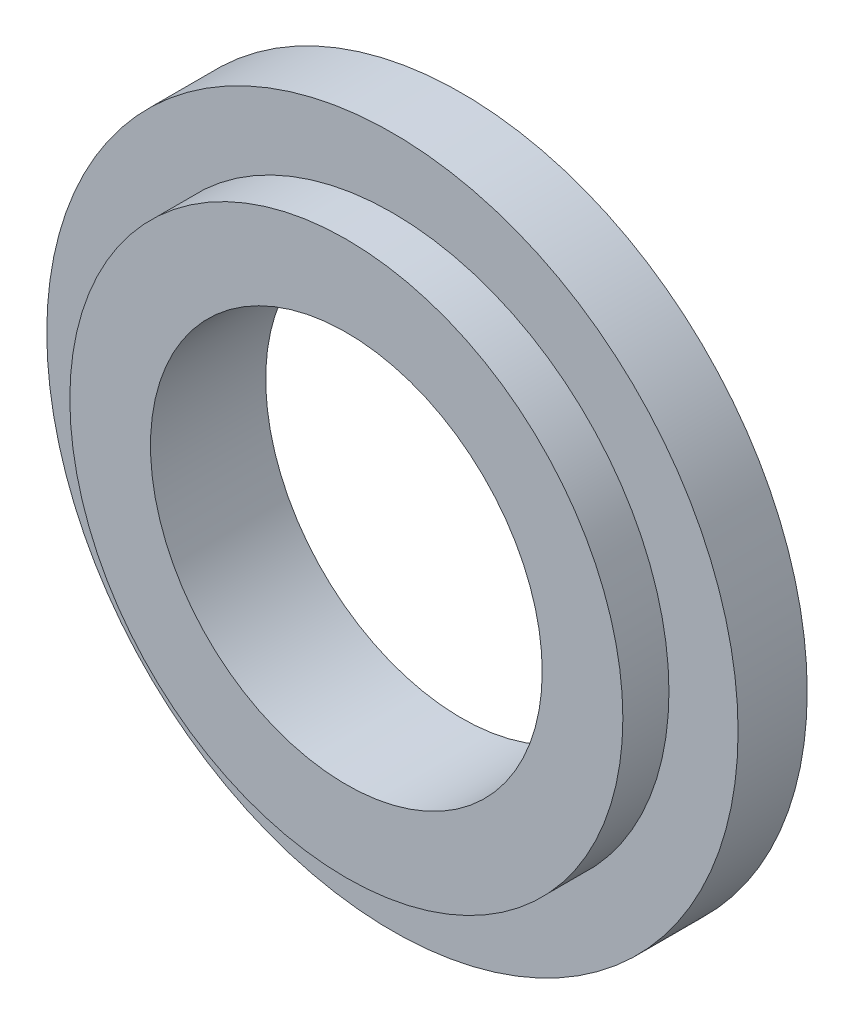
ISO-10303-21;
HEADER;
FILE_DESCRIPTION(('STEP AP214'),'2;1');
FILE_NAME('part.step','',(''),(''),'','','');
FILE_SCHEMA(('AUTOMOTIVE_DESIGN { 1 0 10303 214 1 1 1 1 }'));
ENDSEC;
DATA;
#1=APPLICATION_CONTEXT('core data for automotive mechanical design processes');
#2=APPLICATION_PROTOCOL_DEFINITION('international standard','automotive_design',2000,#1);
#3=PRODUCT_CONTEXT('',#1,'mechanical');
#4=PRODUCT('Part','Part','',(#3));
#5=PRODUCT_RELATED_PRODUCT_CATEGORY('part','',(#4));
#6=PRODUCT_DEFINITION_FORMATION('','',#4);
#7=PRODUCT_DEFINITION_CONTEXT('part definition',#1,'design');
#8=PRODUCT_DEFINITION('design','',#6,#7);
#9=PRODUCT_DEFINITION_SHAPE('','',#8);
#10=(LENGTH_UNIT() NAMED_UNIT(*) SI_UNIT(.MILLI.,.METRE.));
#11=(NAMED_UNIT(*) PLANE_ANGLE_UNIT() SI_UNIT($,.RADIAN.));
#12=(NAMED_UNIT(*) SI_UNIT($,.STERADIAN.) SOLID_ANGLE_UNIT());
#13=UNCERTAINTY_MEASURE_WITH_UNIT(LENGTH_MEASURE(1.E-05),#10,'distance_accuracy_value','');
#14=(GEOMETRIC_REPRESENTATION_CONTEXT(3) GLOBAL_UNCERTAINTY_ASSIGNED_CONTEXT((#13)) GLOBAL_UNIT_ASSIGNED_CONTEXT((#10,
#11,#12)) REPRESENTATION_CONTEXT('',''));
#15=CARTESIAN_POINT('',(0.,0.,0.));
#16=DIRECTION('',(0.,0.,1.));
#17=DIRECTION('',(1.,0.,0.));
#18=AXIS2_PLACEMENT_3D('',#15,#16,#17);
#19=CARTESIAN_POINT('',(0.,0.,3.));
#20=DIRECTION('',(0.,0.,1.));
#21=DIRECTION('',(1.,0.,0.));
#22=AXIS2_PLACEMENT_3D('',#19,#20,#21);
#23=PLANE('',#22);
#24=CARTESIAN_POINT('',(0.,0.,3.));
#25=DIRECTION('',(0.,0.,1.));
#26=DIRECTION('',(1.,0.,0.));
#27=AXIS2_PLACEMENT_3D('',#24,#25,#26);
#28=CIRCLE('',#27,15.);
#29=CARTESIAN_POINT('',(15.,0.,3.));
#30=VERTEX_POINT('',#29);
#31=EDGE_CURVE('E10',#30,#30,#28,.T.);
#32=ORIENTED_EDGE('',*,*,#31,.T.);
#33=EDGE_LOOP('',(#32));
#34=FACE_BOUND('',#33,.T.);
#35=CARTESIAN_POINT('',(0.,0.,3.));
#36=DIRECTION('',(0.,0.,1.));
#37=DIRECTION('',(1.,0.,0.));
#38=AXIS2_PLACEMENT_3D('',#35,#36,#37);
#39=CIRCLE('',#38,12.);
#40=CARTESIAN_POINT('',(12.,0.,3.));
#41=VERTEX_POINT('',#40);
#42=EDGE_CURVE('E45',#41,#41,#39,.T.);
#43=ORIENTED_EDGE('',*,*,#42,.F.);
#44=EDGE_LOOP('',(#43));
#45=FACE_BOUND('',#44,.T.);
#46=ADVANCED_FACE('F29',(#34,#45),#23,.T.);
#47=CARTESIAN_POINT('',(0.,0.,0.));
#48=DIRECTION('',(0.,0.,1.));
#49=DIRECTION('',(1.,0.,0.));
#50=AXIS2_PLACEMENT_3D('',#47,#48,#49);
#51=PLANE('',#50);
#52=CARTESIAN_POINT('',(0.,0.,0.));
#53=DIRECTION('',(0.,0.,1.));
#54=DIRECTION('',(1.,0.,0.));
#55=AXIS2_PLACEMENT_3D('',#52,#53,#54);
#56=CIRCLE('',#55,15.);
#57=CARTESIAN_POINT('',(15.,0.,0.));
#58=VERTEX_POINT('',#57);
#59=EDGE_CURVE('E33',#58,#58,#56,.T.);
#60=ORIENTED_EDGE('',*,*,#59,.F.);
#61=EDGE_LOOP('',(#60));
#62=FACE_BOUND('',#61,.T.);
#63=CARTESIAN_POINT('',(0.,0.,0.));
#64=DIRECTION('',(0.,0.,1.));
#65=DIRECTION('',(1.,0.,0.));
#66=AXIS2_PLACEMENT_3D('',#63,#64,#65);
#67=CIRCLE('',#66,8.5);
#68=CARTESIAN_POINT('',(8.5,0.,0.));
#69=VERTEX_POINT('',#68);
#70=EDGE_CURVE('E40',#69,#69,#67,.T.);
#71=ORIENTED_EDGE('',*,*,#70,.T.);
#72=EDGE_LOOP('',(#71));
#73=FACE_BOUND('',#72,.T.);
#74=ADVANCED_FACE('F70',(#62,#73),#51,.F.);
#75=CARTESIAN_POINT('',(0.,0.,3.));
#76=DIRECTION('',(0.,0.,-1.));
#77=DIRECTION('',(-1.,0.,0.));
#78=AXIS2_PLACEMENT_3D('',#75,#76,#77);
#79=CYLINDRICAL_SURFACE('',#78,15.);
#80=ORIENTED_EDGE('',*,*,#31,.F.);
#81=EDGE_LOOP('',(#80));
#82=FACE_BOUND('',#81,.T.);
#83=ORIENTED_EDGE('',*,*,#59,.T.);
#84=EDGE_LOOP('',(#83));
#85=FACE_BOUND('',#84,.T.);
#86=ADVANCED_FACE('F31',(#82,#85),#79,.T.);
#87=CARTESIAN_POINT('',(0.,0.,3.));
#88=DIRECTION('',(0.,0.,-1.));
#89=DIRECTION('',(-1.,0.,0.));
#90=AXIS2_PLACEMENT_3D('',#87,#88,#89);
#91=CYLINDRICAL_SURFACE('',#90,8.5);
#92=ORIENTED_EDGE('',*,*,#70,.F.);
#93=EDGE_LOOP('',(#92));
#94=FACE_BOUND('',#93,.T.);
#95=CARTESIAN_POINT('',(0.,0.,5.));
#96=DIRECTION('',(0.,0.,1.));
#97=DIRECTION('',(1.,0.,0.));
#98=AXIS2_PLACEMENT_3D('',#95,#96,#97);
#99=CIRCLE('',#98,8.5);
#100=CARTESIAN_POINT('',(8.5,0.,5.));
#101=VERTEX_POINT('',#100);
#102=EDGE_CURVE('E48',#101,#101,#99,.T.);
#103=ORIENTED_EDGE('',*,*,#102,.T.);
#104=EDGE_LOOP('',(#103));
#105=FACE_BOUND('',#104,.T.);
#106=ADVANCED_FACE('F54',(#94,#105),#91,.F.);
#107=CARTESIAN_POINT('',(0.,0.,5.));
#108=DIRECTION('',(0.,0.,1.));
#109=DIRECTION('',(1.,0.,0.));
#110=AXIS2_PLACEMENT_3D('',#107,#108,#109);
#111=PLANE('',#110);
#112=CARTESIAN_POINT('',(0.,0.,5.));
#113=DIRECTION('',(0.,0.,1.));
#114=DIRECTION('',(1.,0.,0.));
#115=AXIS2_PLACEMENT_3D('',#112,#113,#114);
#116=CIRCLE('',#115,12.);
#117=CARTESIAN_POINT('',(12.,0.,5.));
#118=VERTEX_POINT('',#117);
#119=EDGE_CURVE('E44',#118,#118,#116,.T.);
#120=ORIENTED_EDGE('',*,*,#119,.T.);
#121=EDGE_LOOP('',(#120));
#122=FACE_BOUND('',#121,.T.);
#123=ORIENTED_EDGE('',*,*,#102,.F.);
#124=EDGE_LOOP('',(#123));
#125=FACE_BOUND('',#124,.T.);
#126=ADVANCED_FACE('F56',(#122,#125),#111,.T.);
#127=CARTESIAN_POINT('',(0.,0.,5.));
#128=DIRECTION('',(0.,0.,-1.));
#129=DIRECTION('',(-1.,0.,0.));
#130=AXIS2_PLACEMENT_3D('',#127,#128,#129);
#131=CYLINDRICAL_SURFACE('',#130,12.);
#132=ORIENTED_EDGE('',*,*,#119,.F.);
#133=EDGE_LOOP('',(#132));
#134=FACE_BOUND('',#133,.T.);
#135=ORIENTED_EDGE('',*,*,#42,.T.);
#136=EDGE_LOOP('',(#135));
#137=FACE_BOUND('',#136,.T.);
#138=ADVANCED_FACE('F58',(#134,#137),#131,.T.);
#139=CLOSED_SHELL('',(#46,#74,#86,#106,#126,#138));
#140=MANIFOLD_SOLID_BREP('B2',#139);
#141=ADVANCED_BREP_SHAPE_REPRESENTATION('',(#18,#140),#14);
#142=SHAPE_DEFINITION_REPRESENTATION(#9,#141);
ENDSEC;
END-ISO-10303-21;
